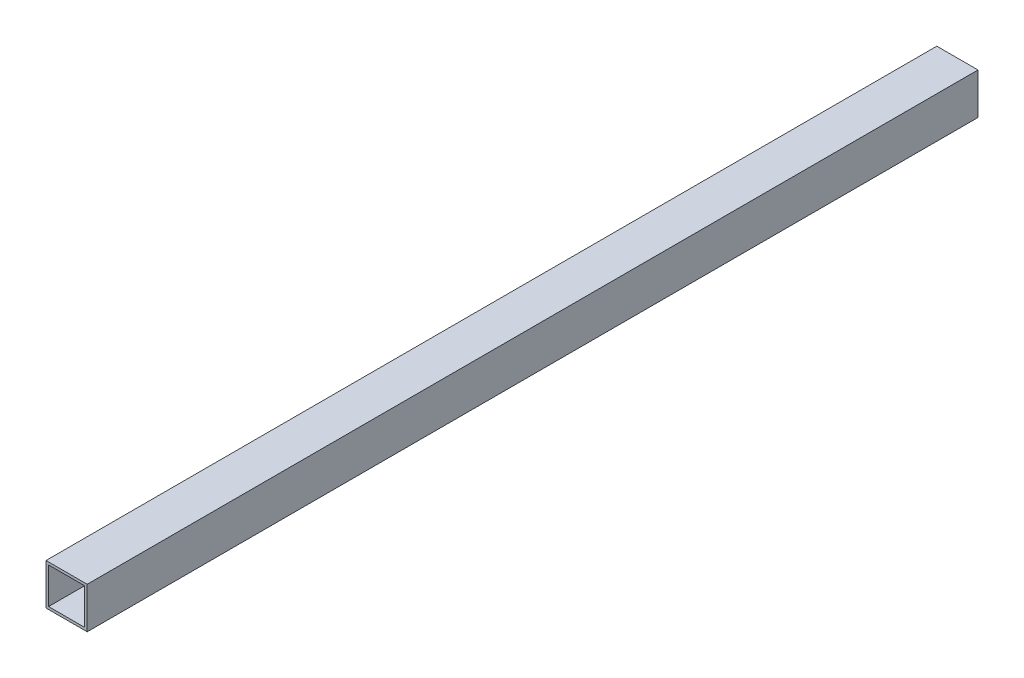
ISO-10303-21;
HEADER;
FILE_DESCRIPTION(('STEP AP214'),'2;1');
FILE_NAME('part.step','',(''),(''),'','','');
FILE_SCHEMA(('AUTOMOTIVE_DESIGN { 1 0 10303 214 1 1 1 1 }'));
ENDSEC;
DATA;
#1=APPLICATION_CONTEXT('core data for automotive mechanical design processes');
#2=APPLICATION_PROTOCOL_DEFINITION('international standard','automotive_design',2000,#1);
#3=PRODUCT_CONTEXT('',#1,'mechanical');
#4=PRODUCT('Part','Part','',(#3));
#5=PRODUCT_RELATED_PRODUCT_CATEGORY('part','',(#4));
#6=PRODUCT_DEFINITION_FORMATION('','',#4);
#7=PRODUCT_DEFINITION_CONTEXT('part definition',#1,'design');
#8=PRODUCT_DEFINITION('design','',#6,#7);
#9=PRODUCT_DEFINITION_SHAPE('','',#8);
#10=(LENGTH_UNIT() NAMED_UNIT(*) SI_UNIT(.MILLI.,.METRE.));
#11=(NAMED_UNIT(*) PLANE_ANGLE_UNIT() SI_UNIT($,.RADIAN.));
#12=(NAMED_UNIT(*) SI_UNIT($,.STERADIAN.) SOLID_ANGLE_UNIT());
#13=UNCERTAINTY_MEASURE_WITH_UNIT(LENGTH_MEASURE(1.E-05),#10,'distance_accuracy_value','');
#14=(GEOMETRIC_REPRESENTATION_CONTEXT(3) GLOBAL_UNCERTAINTY_ASSIGNED_CONTEXT((#13)) GLOBAL_UNIT_ASSIGNED_CONTEXT((#10,
#11,#12)) REPRESENTATION_CONTEXT('',''));
#15=CARTESIAN_POINT('',(0.,0.,0.));
#16=DIRECTION('',(0.,0.,1.));
#17=DIRECTION('',(1.,0.,0.));
#18=AXIS2_PLACEMENT_3D('',#15,#16,#17);
#19=CARTESIAN_POINT('',(0.,0.,1098.55));
#20=DIRECTION('',(0.,0.,1.));
#21=DIRECTION('',(1.,0.,0.));
#22=AXIS2_PLACEMENT_3D('',#19,#20,#21);
#23=PLANE('',#22);
#24=DIRECTION('',(0.,-1.,0.));
#25=VECTOR('',#24,1.);
#26=CARTESIAN_POINT('',(-25.4000000000001,-25.4,1098.55));
#27=LINE('',#26,#25);
#28=CARTESIAN_POINT('',(-25.4000000000001,25.4,1098.55));
#29=VERTEX_POINT('',#28);
#30=CARTESIAN_POINT('',(-25.4000000000001,-25.4,1098.55));
#31=VERTEX_POINT('',#30);
#32=EDGE_CURVE('E133',#29,#31,#27,.T.);
#33=ORIENTED_EDGE('',*,*,#32,.T.);
#34=DIRECTION('',(1.,0.,0.));
#35=VECTOR('',#34,1.);
#36=CARTESIAN_POINT('',(25.4000000000001,-25.4,1098.55));
#37=LINE('',#36,#35);
#38=CARTESIAN_POINT('',(25.4000000000001,-25.4,1098.55));
#39=VERTEX_POINT('',#38);
#40=EDGE_CURVE('E136',#31,#39,#37,.T.);
#41=ORIENTED_EDGE('',*,*,#40,.T.);
#42=DIRECTION('',(0.,1.,0.));
#43=VECTOR('',#42,1.);
#44=CARTESIAN_POINT('',(25.4000000000001,-25.4,1098.55));
#45=LINE('',#44,#43);
#46=CARTESIAN_POINT('',(25.4000000000001,25.4,1098.55));
#47=VERTEX_POINT('',#46);
#48=EDGE_CURVE('E139',#39,#47,#45,.T.);
#49=ORIENTED_EDGE('',*,*,#48,.T.);
#50=DIRECTION('',(-1.,0.,0.));
#51=VECTOR('',#50,1.);
#52=CARTESIAN_POINT('',(25.4000000000001,25.4,1098.55));
#53=LINE('',#52,#51);
#54=EDGE_CURVE('E141',#47,#29,#53,.T.);
#55=ORIENTED_EDGE('',*,*,#54,.T.);
#56=EDGE_LOOP('',(#33,#41,#49,#55));
#57=FACE_BOUND('',#56,.T.);
#58=DIRECTION('',(0.,1.,0.));
#59=VECTOR('',#58,1.);
#60=CARTESIAN_POINT('',(22.2249999999999,-22.2250000000001,1098.55));
#61=LINE('',#60,#59);
#62=CARTESIAN_POINT('',(22.2249999999999,-22.2250000000001,1098.55));
#63=VERTEX_POINT('',#62);
#64=CARTESIAN_POINT('',(22.2249999999999,22.2250000000001,1098.55));
#65=VERTEX_POINT('',#64);
#66=EDGE_CURVE('E105',#63,#65,#61,.T.);
#67=ORIENTED_EDGE('',*,*,#66,.F.);
#68=DIRECTION('',(1.,0.,0.));
#69=VECTOR('',#68,1.);
#70=CARTESIAN_POINT('',(22.2249999999999,-22.2250000000001,1098.55));
#71=LINE('',#70,#69);
#72=CARTESIAN_POINT('',(-22.2249999999999,-22.2250000000001,1098.55));
#73=VERTEX_POINT('',#72);
#74=EDGE_CURVE('E97',#73,#63,#71,.T.);
#75=ORIENTED_EDGE('',*,*,#74,.F.);
#76=DIRECTION('',(0.,-1.,0.));
#77=VECTOR('',#76,1.);
#78=CARTESIAN_POINT('',(-22.2249999999999,-22.2250000000001,1098.55));
#79=LINE('',#78,#77);
#80=CARTESIAN_POINT('',(-22.2249999999999,22.2250000000001,1098.55));
#81=VERTEX_POINT('',#80);
#82=EDGE_CURVE('E119',#81,#73,#79,.T.);
#83=ORIENTED_EDGE('',*,*,#82,.F.);
#84=DIRECTION('',(-1.,0.,0.));
#85=VECTOR('',#84,1.);
#86=CARTESIAN_POINT('',(22.2249999999999,22.2250000000001,1098.55));
#87=LINE('',#86,#85);
#88=EDGE_CURVE('E117',#65,#81,#87,.T.);
#89=ORIENTED_EDGE('',*,*,#88,.F.);
#90=EDGE_LOOP('',(#67,#75,#83,#89));
#91=FACE_BOUND('',#90,.T.);
#92=ADVANCED_FACE('F32',(#57,#91),#23,.T.);
#93=CARTESIAN_POINT('',(0.,0.,0.));
#94=DIRECTION('',(0.,0.,1.));
#95=DIRECTION('',(1.,0.,0.));
#96=AXIS2_PLACEMENT_3D('',#93,#94,#95);
#97=PLANE('',#96);
#98=DIRECTION('',(0.,-1.,0.));
#99=VECTOR('',#98,1.);
#100=CARTESIAN_POINT('',(-25.4000000000001,-25.4,0.));
#101=LINE('',#100,#99);
#102=CARTESIAN_POINT('',(-25.4000000000001,25.4,0.));
#103=VERTEX_POINT('',#102);
#104=CARTESIAN_POINT('',(-25.4000000000001,-25.4,0.));
#105=VERTEX_POINT('',#104);
#106=EDGE_CURVE('E113',#103,#105,#101,.T.);
#107=ORIENTED_EDGE('',*,*,#106,.F.);
#108=DIRECTION('',(-1.,0.,0.));
#109=VECTOR('',#108,1.);
#110=CARTESIAN_POINT('',(25.4000000000001,25.4,0.));
#111=LINE('',#110,#109);
#112=CARTESIAN_POINT('',(25.4000000000001,25.4,0.));
#113=VERTEX_POINT('',#112);
#114=EDGE_CURVE('E137',#113,#103,#111,.T.);
#115=ORIENTED_EDGE('',*,*,#114,.F.);
#116=DIRECTION('',(0.,1.,0.));
#117=VECTOR('',#116,1.);
#118=CARTESIAN_POINT('',(25.4000000000001,-25.4000000000003,0.));
#119=LINE('',#118,#117);
#120=CARTESIAN_POINT('',(25.4000000000001,-25.4000000000003,0.));
#121=VERTEX_POINT('',#120);
#122=EDGE_CURVE('E148',#121,#113,#119,.T.);
#123=ORIENTED_EDGE('',*,*,#122,.F.);
#124=DIRECTION('',(1.,0.,0.));
#125=VECTOR('',#124,1.);
#126=CARTESIAN_POINT('',(25.4000000000001,-25.4000000000003,0.));
#127=LINE('',#126,#125);
#128=EDGE_CURVE('E146',#105,#121,#127,.T.);
#129=ORIENTED_EDGE('',*,*,#128,.F.);
#130=EDGE_LOOP('',(#107,#115,#123,#129));
#131=FACE_BOUND('',#130,.T.);
#132=DIRECTION('',(1.,0.,0.));
#133=VECTOR('',#132,1.);
#134=CARTESIAN_POINT('',(22.2249999999999,-22.2250000000003,0.));
#135=LINE('',#134,#133);
#136=CARTESIAN_POINT('',(-22.2249999999999,-22.2250000000001,0.));
#137=VERTEX_POINT('',#136);
#138=CARTESIAN_POINT('',(22.2249999999999,-22.2250000000003,0.));
#139=VERTEX_POINT('',#138);
#140=EDGE_CURVE('E55',#137,#139,#135,.T.);
#141=ORIENTED_EDGE('',*,*,#140,.T.);
#142=DIRECTION('',(0.,1.,0.));
#143=VECTOR('',#142,1.);
#144=CARTESIAN_POINT('',(22.2249999999999,-22.2250000000003,0.));
#145=LINE('',#144,#143);
#146=CARTESIAN_POINT('',(22.2249999999999,22.2250000000001,0.));
#147=VERTEX_POINT('',#146);
#148=EDGE_CURVE('E112',#139,#147,#145,.T.);
#149=ORIENTED_EDGE('',*,*,#148,.T.);
#150=DIRECTION('',(-1.,0.,0.));
#151=VECTOR('',#150,1.);
#152=CARTESIAN_POINT('',(22.2249999999999,22.2250000000001,0.));
#153=LINE('',#152,#151);
#154=CARTESIAN_POINT('',(-22.2249999999999,22.2250000000001,0.));
#155=VERTEX_POINT('',#154);
#156=EDGE_CURVE('E125',#147,#155,#153,.T.);
#157=ORIENTED_EDGE('',*,*,#156,.T.);
#158=DIRECTION('',(0.,-1.,0.));
#159=VECTOR('',#158,1.);
#160=CARTESIAN_POINT('',(-22.2249999999999,-22.2250000000001,0.));
#161=LINE('',#160,#159);
#162=EDGE_CURVE('E106',#155,#137,#161,.T.);
#163=ORIENTED_EDGE('',*,*,#162,.T.);
#164=EDGE_LOOP('',(#141,#149,#157,#163));
#165=FACE_BOUND('',#164,.T.);
#166=ADVANCED_FACE('F166',(#131,#165),#97,.F.);
#167=CARTESIAN_POINT('',(-25.4000000000001,-25.4,1098.55));
#168=DIRECTION('',(1.,0.,0.));
#169=DIRECTION('',(0.,0.,-1.));
#170=AXIS2_PLACEMENT_3D('',#167,#168,#169);
#171=PLANE('',#170);
#172=ORIENTED_EDGE('',*,*,#106,.T.);
#173=DIRECTION('',(0.,0.,-1.));
#174=VECTOR('',#173,1.);
#175=CARTESIAN_POINT('',(-25.4000000000001,-25.4,1098.55));
#176=LINE('',#175,#174);
#177=EDGE_CURVE('E11',#31,#105,#176,.T.);
#178=ORIENTED_EDGE('',*,*,#177,.F.);
#179=ORIENTED_EDGE('',*,*,#32,.F.);
#180=DIRECTION('',(0.,0.,-1.));
#181=VECTOR('',#180,1.);
#182=CARTESIAN_POINT('',(-25.4000000000001,25.4,1098.55));
#183=LINE('',#182,#181);
#184=EDGE_CURVE('E143',#29,#103,#183,.T.);
#185=ORIENTED_EDGE('',*,*,#184,.T.);
#186=EDGE_LOOP('',(#172,#178,#179,#185));
#187=FACE_BOUND('',#186,.T.);
#188=ADVANCED_FACE('F34',(#187),#171,.F.);
#189=CARTESIAN_POINT('',(25.4000000000001,-25.4,1098.55));
#190=DIRECTION('',(0.,1.,0.));
#191=DIRECTION('',(0.,0.,1.));
#192=AXIS2_PLACEMENT_3D('',#189,#190,#191);
#193=PLANE('',#192);
#194=ORIENTED_EDGE('',*,*,#128,.T.);
#195=DIRECTION('',(0.,0.,-1.));
#196=VECTOR('',#195,1.);
#197=CARTESIAN_POINT('',(25.4000000000001,-25.4,1098.55));
#198=LINE('',#197,#196);
#199=EDGE_CURVE('E40',#39,#121,#198,.T.);
#200=ORIENTED_EDGE('',*,*,#199,.F.);
#201=ORIENTED_EDGE('',*,*,#40,.F.);
#202=ORIENTED_EDGE('',*,*,#177,.T.);
#203=EDGE_LOOP('',(#194,#200,#201,#202));
#204=FACE_BOUND('',#203,.T.);
#205=ADVANCED_FACE('F176',(#204),#193,.F.);
#206=CARTESIAN_POINT('',(25.4000000000001,-25.4,1098.55));
#207=DIRECTION('',(-1.,0.,0.));
#208=DIRECTION('',(0.,0.,1.));
#209=AXIS2_PLACEMENT_3D('',#206,#207,#208);
#210=PLANE('',#209);
#211=ORIENTED_EDGE('',*,*,#122,.T.);
#212=DIRECTION('',(0.,0.,-1.));
#213=VECTOR('',#212,1.);
#214=CARTESIAN_POINT('',(25.4000000000001,25.4,1098.55));
#215=LINE('',#214,#213);
#216=EDGE_CURVE('E153',#47,#113,#215,.T.);
#217=ORIENTED_EDGE('',*,*,#216,.F.);
#218=ORIENTED_EDGE('',*,*,#48,.F.);
#219=ORIENTED_EDGE('',*,*,#199,.T.);
#220=EDGE_LOOP('',(#211,#217,#218,#219));
#221=FACE_BOUND('',#220,.T.);
#222=ADVANCED_FACE('F160',(#221),#210,.F.);
#223=CARTESIAN_POINT('',(25.4000000000001,25.4,1098.55));
#224=DIRECTION('',(0.,-1.,0.));
#225=DIRECTION('',(0.,0.,-1.));
#226=AXIS2_PLACEMENT_3D('',#223,#224,#225);
#227=PLANE('',#226);
#228=ORIENTED_EDGE('',*,*,#114,.T.);
#229=ORIENTED_EDGE('',*,*,#184,.F.);
#230=ORIENTED_EDGE('',*,*,#54,.F.);
#231=ORIENTED_EDGE('',*,*,#216,.T.);
#232=EDGE_LOOP('',(#228,#229,#230,#231));
#233=FACE_BOUND('',#232,.T.);
#234=ADVANCED_FACE('F170',(#233),#227,.F.);
#235=CARTESIAN_POINT('',(22.2249999999999,-22.2250000000001,1098.55));
#236=DIRECTION('',(0.,1.,0.));
#237=DIRECTION('',(0.,0.,1.));
#238=AXIS2_PLACEMENT_3D('',#235,#236,#237);
#239=PLANE('',#238);
#240=ORIENTED_EDGE('',*,*,#140,.F.);
#241=DIRECTION('',(0.,0.,-1.));
#242=VECTOR('',#241,1.);
#243=CARTESIAN_POINT('',(-22.2249999999999,-22.2250000000001,1098.55));
#244=LINE('',#243,#242);
#245=EDGE_CURVE('E101',#73,#137,#244,.T.);
#246=ORIENTED_EDGE('',*,*,#245,.F.);
#247=ORIENTED_EDGE('',*,*,#74,.T.);
#248=DIRECTION('',(0.,0.,-1.));
#249=VECTOR('',#248,1.);
#250=CARTESIAN_POINT('',(22.2249999999999,-22.2250000000001,1098.55));
#251=LINE('',#250,#249);
#252=EDGE_CURVE('E100',#63,#139,#251,.T.);
#253=ORIENTED_EDGE('',*,*,#252,.T.);
#254=EDGE_LOOP('',(#240,#246,#247,#253));
#255=FACE_BOUND('',#254,.T.);
#256=ADVANCED_FACE('F99',(#255),#239,.T.);
#257=CARTESIAN_POINT('',(22.2249999999999,-22.2250000000001,1098.55));
#258=DIRECTION('',(-1.,0.,0.));
#259=DIRECTION('',(0.,0.,1.));
#260=AXIS2_PLACEMENT_3D('',#257,#258,#259);
#261=PLANE('',#260);
#262=ORIENTED_EDGE('',*,*,#148,.F.);
#263=ORIENTED_EDGE('',*,*,#252,.F.);
#264=ORIENTED_EDGE('',*,*,#66,.T.);
#265=DIRECTION('',(0.,0.,-1.));
#266=VECTOR('',#265,1.);
#267=CARTESIAN_POINT('',(22.2249999999999,22.2250000000001,1098.55));
#268=LINE('',#267,#266);
#269=EDGE_CURVE('E114',#65,#147,#268,.T.);
#270=ORIENTED_EDGE('',*,*,#269,.T.);
#271=EDGE_LOOP('',(#262,#263,#264,#270));
#272=FACE_BOUND('',#271,.T.);
#273=ADVANCED_FACE('F109',(#272),#261,.T.);
#274=CARTESIAN_POINT('',(22.2249999999999,22.2250000000001,1098.55));
#275=DIRECTION('',(0.,-1.,0.));
#276=DIRECTION('',(0.,0.,-1.));
#277=AXIS2_PLACEMENT_3D('',#274,#275,#276);
#278=PLANE('',#277);
#279=ORIENTED_EDGE('',*,*,#156,.F.);
#280=ORIENTED_EDGE('',*,*,#269,.F.);
#281=ORIENTED_EDGE('',*,*,#88,.T.);
#282=DIRECTION('',(0.,0.,-1.));
#283=VECTOR('',#282,1.);
#284=CARTESIAN_POINT('',(-22.2249999999999,22.2250000000001,1098.55));
#285=LINE('',#284,#283);
#286=EDGE_CURVE('E47',#81,#155,#285,.T.);
#287=ORIENTED_EDGE('',*,*,#286,.T.);
#288=EDGE_LOOP('',(#279,#280,#281,#287));
#289=FACE_BOUND('',#288,.T.);
#290=ADVANCED_FACE('F199',(#289),#278,.T.);
#291=CARTESIAN_POINT('',(-22.2249999999999,-22.2250000000001,1098.55));
#292=DIRECTION('',(1.,0.,0.));
#293=DIRECTION('',(0.,0.,-1.));
#294=AXIS2_PLACEMENT_3D('',#291,#292,#293);
#295=PLANE('',#294);
#296=ORIENTED_EDGE('',*,*,#162,.F.);
#297=ORIENTED_EDGE('',*,*,#286,.F.);
#298=ORIENTED_EDGE('',*,*,#82,.T.);
#299=ORIENTED_EDGE('',*,*,#245,.T.);
#300=EDGE_LOOP('',(#296,#297,#298,#299));
#301=FACE_BOUND('',#300,.T.);
#302=ADVANCED_FACE('F203',(#301),#295,.T.);
#303=CLOSED_SHELL('',(#92,#166,#188,#205,#222,#234,#256,#273,#290,#302));
#304=MANIFOLD_SOLID_BREP('B2',#303);
#305=ADVANCED_BREP_SHAPE_REPRESENTATION('',(#18,#304),#14);
#306=SHAPE_DEFINITION_REPRESENTATION(#9,#305);
ENDSEC;
END-ISO-10303-21;
